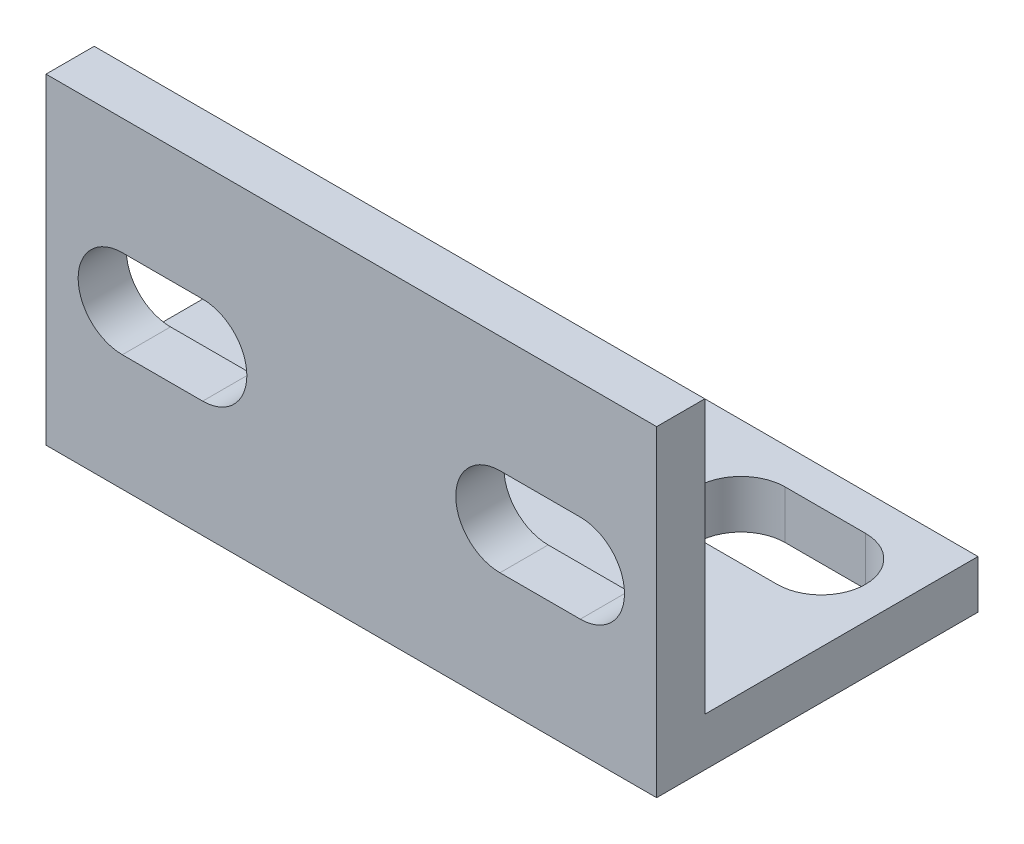
ISO-10303-21;
HEADER;
FILE_DESCRIPTION(('STEP AP214'),'2;1');
FILE_NAME('part.step','',(''),(''),'','','');
FILE_SCHEMA(('AUTOMOTIVE_DESIGN { 1 0 10303 214 1 1 1 1 }'));
ENDSEC;
DATA;
#1=APPLICATION_CONTEXT('core data for automotive mechanical design processes');
#2=APPLICATION_PROTOCOL_DEFINITION('international standard','automotive_design',2000,#1);
#3=PRODUCT_CONTEXT('',#1,'mechanical');
#4=PRODUCT('Part','Part','',(#3));
#5=PRODUCT_RELATED_PRODUCT_CATEGORY('part','',(#4));
#6=PRODUCT_DEFINITION_FORMATION('','',#4);
#7=PRODUCT_DEFINITION_CONTEXT('part definition',#1,'design');
#8=PRODUCT_DEFINITION('design','',#6,#7);
#9=PRODUCT_DEFINITION_SHAPE('','',#8);
#10=(LENGTH_UNIT() NAMED_UNIT(*) SI_UNIT(.MILLI.,.METRE.));
#11=(NAMED_UNIT(*) PLANE_ANGLE_UNIT() SI_UNIT($,.RADIAN.));
#12=(NAMED_UNIT(*) SI_UNIT($,.STERADIAN.) SOLID_ANGLE_UNIT());
#13=UNCERTAINTY_MEASURE_WITH_UNIT(LENGTH_MEASURE(1.E-05),#10,'distance_accuracy_value','');
#14=(GEOMETRIC_REPRESENTATION_CONTEXT(3) GLOBAL_UNCERTAINTY_ASSIGNED_CONTEXT((#13)) GLOBAL_UNIT_ASSIGNED_CONTEXT((#10,
#11,#12)) REPRESENTATION_CONTEXT('',''));
#15=CARTESIAN_POINT('',(0.,0.,0.));
#16=DIRECTION('',(0.,0.,1.));
#17=DIRECTION('',(1.,0.,0.));
#18=AXIS2_PLACEMENT_3D('',#15,#16,#17);
#19=CARTESIAN_POINT('',(-38.,3.,-20.));
#20=DIRECTION('',(0.,1.,0.));
#21=DIRECTION('',(0.,0.,1.));
#22=AXIS2_PLACEMENT_3D('',#19,#20,#21);
#23=PLANE('',#22);
#24=DIRECTION('',(0.,0.,1.));
#25=VECTOR('',#24,1.);
#26=CARTESIAN_POINT('',(0.,3.,-20.));
#27=LINE('',#26,#25);
#28=CARTESIAN_POINT('',(0.,3.,-20.));
#29=VERTEX_POINT('',#28);
#30=CARTESIAN_POINT('',(0.,3.,-3.));
#31=VERTEX_POINT('',#30);
#32=EDGE_CURVE('E343',#29,#31,#27,.T.);
#33=ORIENTED_EDGE('',*,*,#32,.F.);
#34=DIRECTION('',(1.,0.,0.));
#35=VECTOR('',#34,1.);
#36=CARTESIAN_POINT('',(-38.,3.,-20.));
#37=LINE('',#36,#35);
#38=CARTESIAN_POINT('',(-38.,3.,-20.));
#39=VERTEX_POINT('',#38);
#40=EDGE_CURVE('E349',#39,#29,#37,.T.);
#41=ORIENTED_EDGE('',*,*,#40,.F.);
#42=DIRECTION('',(0.,0.,1.));
#43=VECTOR('',#42,1.);
#44=CARTESIAN_POINT('',(-38.,3.,-20.));
#45=LINE('',#44,#43);
#46=CARTESIAN_POINT('',(-38.,3.,-3.));
#47=VERTEX_POINT('',#46);
#48=EDGE_CURVE('E326',#39,#47,#45,.T.);
#49=ORIENTED_EDGE('',*,*,#48,.T.);
#50=DIRECTION('',(1.,0.,0.));
#51=VECTOR('',#50,1.);
#52=CARTESIAN_POINT('',(-38.,3.,-3.));
#53=LINE('',#52,#51);
#54=EDGE_CURVE('E42',#47,#31,#53,.T.);
#55=ORIENTED_EDGE('',*,*,#54,.T.);
#56=EDGE_LOOP('',(#33,#41,#49,#55));
#57=FACE_BOUND('',#56,.T.);
#58=CARTESIAN_POINT('',(-4.75,3.,-15.));
#59=DIRECTION('',(0.,1.,0.));
#60=DIRECTION('',(0.,0.,1.));
#61=AXIS2_PLACEMENT_3D('',#58,#59,#60);
#62=CIRCLE('',#61,2.75);
#63=CARTESIAN_POINT('',(-4.75,3.,-12.25));
#64=VERTEX_POINT('',#63);
#65=CARTESIAN_POINT('',(-4.75,3.,-17.75));
#66=VERTEX_POINT('',#65);
#67=EDGE_CURVE('E243',#64,#66,#62,.T.);
#68=ORIENTED_EDGE('',*,*,#67,.F.);
#69=DIRECTION('',(1.,0.,0.));
#70=VECTOR('',#69,1.);
#71=CARTESIAN_POINT('',(-4.75,3.,-12.25));
#72=LINE('',#71,#70);
#73=CARTESIAN_POINT('',(-9.75,3.,-12.25));
#74=VERTEX_POINT('',#73);
#75=EDGE_CURVE('E254',#74,#64,#72,.T.);
#76=ORIENTED_EDGE('',*,*,#75,.F.);
#77=CARTESIAN_POINT('',(-9.75,3.,-15.));
#78=DIRECTION('',(0.,1.,0.));
#79=DIRECTION('',(0.,0.,1.));
#80=AXIS2_PLACEMENT_3D('',#77,#78,#79);
#81=CIRCLE('',#80,2.75);
#82=CARTESIAN_POINT('',(-9.75,3.,-17.75));
#83=VERTEX_POINT('',#82);
#84=EDGE_CURVE('E268',#83,#74,#81,.T.);
#85=ORIENTED_EDGE('',*,*,#84,.F.);
#86=DIRECTION('',(-1.,0.,0.));
#87=VECTOR('',#86,1.);
#88=CARTESIAN_POINT('',(-4.75,3.,-17.75));
#89=LINE('',#88,#87);
#90=EDGE_CURVE('E265',#66,#83,#89,.T.);
#91=ORIENTED_EDGE('',*,*,#90,.F.);
#92=EDGE_LOOP('',(#68,#76,#85,#91));
#93=FACE_BOUND('',#92,.T.);
#94=DIRECTION('',(-1.,0.,0.));
#95=VECTOR('',#94,1.);
#96=CARTESIAN_POINT('',(-33.25,3.,-12.25));
#97=LINE('',#96,#95);
#98=CARTESIAN_POINT('',(-28.25,3.,-12.25));
#99=VERTEX_POINT('',#98);
#100=CARTESIAN_POINT('',(-33.25,3.,-12.25));
#101=VERTEX_POINT('',#100);
#102=EDGE_CURVE('E208',#99,#101,#97,.T.);
#103=ORIENTED_EDGE('',*,*,#102,.T.);
#104=CARTESIAN_POINT('',(-33.25,3.,-15.));
#105=DIRECTION('',(0.,-1.,0.));
#106=DIRECTION('',(0.,0.,1.));
#107=AXIS2_PLACEMENT_3D('',#104,#105,#106);
#108=CIRCLE('',#107,2.75);
#109=CARTESIAN_POINT('',(-33.25,3.,-17.75));
#110=VERTEX_POINT('',#109);
#111=EDGE_CURVE('E50',#101,#110,#108,.T.);
#112=ORIENTED_EDGE('',*,*,#111,.T.);
#113=DIRECTION('',(1.,0.,0.));
#114=VECTOR('',#113,1.);
#115=CARTESIAN_POINT('',(-33.25,3.,-17.75));
#116=LINE('',#115,#114);
#117=CARTESIAN_POINT('',(-28.25,3.,-17.75));
#118=VERTEX_POINT('',#117);
#119=EDGE_CURVE('E199',#110,#118,#116,.T.);
#120=ORIENTED_EDGE('',*,*,#119,.T.);
#121=CARTESIAN_POINT('',(-28.25,3.,-15.));
#122=DIRECTION('',(0.,-1.,0.));
#123=DIRECTION('',(0.,0.,1.));
#124=AXIS2_PLACEMENT_3D('',#121,#122,#123);
#125=CIRCLE('',#124,2.75);
#126=EDGE_CURVE('E202',#118,#99,#125,.T.);
#127=ORIENTED_EDGE('',*,*,#126,.T.);
#128=EDGE_LOOP('',(#103,#112,#120,#127));
#129=FACE_BOUND('',#128,.T.);
#130=ADVANCED_FACE('F33',(#57,#93,#129),#23,.T.);
#131=CARTESIAN_POINT('',(-38.,0.,0.));
#132=DIRECTION('',(0.,-1.,0.));
#133=DIRECTION('',(0.,0.,-1.));
#134=AXIS2_PLACEMENT_3D('',#131,#132,#133);
#135=PLANE('',#134);
#136=DIRECTION('',(0.,0.,-1.));
#137=VECTOR('',#136,1.);
#138=CARTESIAN_POINT('',(0.,0.,0.));
#139=LINE('',#138,#137);
#140=CARTESIAN_POINT('',(0.,0.,0.));
#141=VERTEX_POINT('',#140);
#142=CARTESIAN_POINT('',(0.,0.,-20.));
#143=VERTEX_POINT('',#142);
#144=EDGE_CURVE('E337',#141,#143,#139,.T.);
#145=ORIENTED_EDGE('',*,*,#144,.F.);
#146=DIRECTION('',(1.,0.,0.));
#147=VECTOR('',#146,1.);
#148=CARTESIAN_POINT('',(-38.,0.,0.));
#149=LINE('',#148,#147);
#150=CARTESIAN_POINT('',(-38.,0.,0.));
#151=VERTEX_POINT('',#150);
#152=EDGE_CURVE('E352',#151,#141,#149,.T.);
#153=ORIENTED_EDGE('',*,*,#152,.F.);
#154=DIRECTION('',(0.,0.,-1.));
#155=VECTOR('',#154,1.);
#156=CARTESIAN_POINT('',(-38.,0.,0.));
#157=LINE('',#156,#155);
#158=CARTESIAN_POINT('',(-38.,0.,-20.));
#159=VERTEX_POINT('',#158);
#160=EDGE_CURVE('E320',#151,#159,#157,.T.);
#161=ORIENTED_EDGE('',*,*,#160,.T.);
#162=DIRECTION('',(1.,0.,0.));
#163=VECTOR('',#162,1.);
#164=CARTESIAN_POINT('',(-38.,0.,-20.));
#165=LINE('',#164,#163);
#166=EDGE_CURVE('E351',#159,#143,#165,.T.);
#167=ORIENTED_EDGE('',*,*,#166,.T.);
#168=EDGE_LOOP('',(#145,#153,#161,#167));
#169=FACE_BOUND('',#168,.T.);
#170=CARTESIAN_POINT('',(-4.75,0.,-15.));
#171=DIRECTION('',(0.,1.,0.));
#172=DIRECTION('',(0.,0.,1.));
#173=AXIS2_PLACEMENT_3D('',#170,#171,#172);
#174=CIRCLE('',#173,2.75);
#175=CARTESIAN_POINT('',(-4.75,0.,-12.25));
#176=VERTEX_POINT('',#175);
#177=CARTESIAN_POINT('',(-4.75,0.,-17.75));
#178=VERTEX_POINT('',#177);
#179=EDGE_CURVE('E250',#176,#178,#174,.T.);
#180=ORIENTED_EDGE('',*,*,#179,.T.);
#181=DIRECTION('',(-1.,0.,0.));
#182=VECTOR('',#181,1.);
#183=CARTESIAN_POINT('',(-4.75,0.,-17.75));
#184=LINE('',#183,#182);
#185=CARTESIAN_POINT('',(-9.75,0.,-17.75));
#186=VERTEX_POINT('',#185);
#187=EDGE_CURVE('E253',#178,#186,#184,.T.);
#188=ORIENTED_EDGE('',*,*,#187,.T.);
#189=CARTESIAN_POINT('',(-9.75,0.,-15.));
#190=DIRECTION('',(0.,1.,0.));
#191=DIRECTION('',(0.,0.,1.));
#192=AXIS2_PLACEMENT_3D('',#189,#190,#191);
#193=CIRCLE('',#192,2.75);
#194=CARTESIAN_POINT('',(-9.75,0.,-12.25));
#195=VERTEX_POINT('',#194);
#196=EDGE_CURVE('E257',#186,#195,#193,.T.);
#197=ORIENTED_EDGE('',*,*,#196,.T.);
#198=DIRECTION('',(1.,0.,0.));
#199=VECTOR('',#198,1.);
#200=CARTESIAN_POINT('',(-4.75,0.,-12.25));
#201=LINE('',#200,#199);
#202=EDGE_CURVE('E260',#195,#176,#201,.T.);
#203=ORIENTED_EDGE('',*,*,#202,.T.);
#204=EDGE_LOOP('',(#180,#188,#197,#203));
#205=FACE_BOUND('',#204,.T.);
#206=DIRECTION('',(1.,0.,0.));
#207=VECTOR('',#206,1.);
#208=CARTESIAN_POINT('',(-33.25,0.,-17.75));
#209=LINE('',#208,#207);
#210=CARTESIAN_POINT('',(-33.25,0.,-17.75));
#211=VERTEX_POINT('',#210);
#212=CARTESIAN_POINT('',(-28.25,0.,-17.75));
#213=VERTEX_POINT('',#212);
#214=EDGE_CURVE('E195',#211,#213,#209,.T.);
#215=ORIENTED_EDGE('',*,*,#214,.F.);
#216=CARTESIAN_POINT('',(-33.25,0.,-15.));
#217=DIRECTION('',(0.,-1.,0.));
#218=DIRECTION('',(0.,0.,1.));
#219=AXIS2_PLACEMENT_3D('',#216,#217,#218);
#220=CIRCLE('',#219,2.75);
#221=CARTESIAN_POINT('',(-33.25,0.,-12.25));
#222=VERTEX_POINT('',#221);
#223=EDGE_CURVE('E191',#222,#211,#220,.T.);
#224=ORIENTED_EDGE('',*,*,#223,.F.);
#225=DIRECTION('',(-1.,0.,0.));
#226=VECTOR('',#225,1.);
#227=CARTESIAN_POINT('',(-33.25,0.,-12.25));
#228=LINE('',#227,#226);
#229=CARTESIAN_POINT('',(-28.25,0.,-12.25));
#230=VERTEX_POINT('',#229);
#231=EDGE_CURVE('E183',#230,#222,#228,.T.);
#232=ORIENTED_EDGE('',*,*,#231,.F.);
#233=CARTESIAN_POINT('',(-28.25,0.,-15.));
#234=DIRECTION('',(0.,-1.,0.));
#235=DIRECTION('',(0.,0.,1.));
#236=AXIS2_PLACEMENT_3D('',#233,#234,#235);
#237=CIRCLE('',#236,2.75);
#238=EDGE_CURVE('E190',#213,#230,#237,.T.);
#239=ORIENTED_EDGE('',*,*,#238,.F.);
#240=EDGE_LOOP('',(#215,#224,#232,#239));
#241=FACE_BOUND('',#240,.T.);
#242=ADVANCED_FACE('F198',(#169,#205,#241),#135,.T.);
#243=CARTESIAN_POINT('',(-38.,3.,-3.));
#244=DIRECTION('',(0.,0.,-1.));
#245=DIRECTION('',(0.,1.,0.));
#246=AXIS2_PLACEMENT_3D('',#243,#244,#245);
#247=PLANE('',#246);
#248=DIRECTION('',(0.,1.,0.));
#249=VECTOR('',#248,1.);
#250=CARTESIAN_POINT('',(0.,3.,-3.));
#251=LINE('',#250,#249);
#252=CARTESIAN_POINT('',(0.,20.,-3.));
#253=VERTEX_POINT('',#252);
#254=EDGE_CURVE('E317',#31,#253,#251,.T.);
#255=ORIENTED_EDGE('',*,*,#254,.F.);
#256=ORIENTED_EDGE('',*,*,#54,.F.);
#257=DIRECTION('',(0.,1.,0.));
#258=VECTOR('',#257,1.);
#259=CARTESIAN_POINT('',(-38.,3.,-3.));
#260=LINE('',#259,#258);
#261=CARTESIAN_POINT('',(-38.,20.,-3.));
#262=VERTEX_POINT('',#261);
#263=EDGE_CURVE('E329',#47,#262,#260,.T.);
#264=ORIENTED_EDGE('',*,*,#263,.T.);
#265=DIRECTION('',(1.,0.,0.));
#266=VECTOR('',#265,1.);
#267=CARTESIAN_POINT('',(-38.,20.,-3.));
#268=LINE('',#267,#266);
#269=EDGE_CURVE('E11',#262,#253,#268,.T.);
#270=ORIENTED_EDGE('',*,*,#269,.T.);
#271=EDGE_LOOP('',(#255,#256,#264,#270));
#272=FACE_BOUND('',#271,.T.);
#273=CARTESIAN_POINT('',(-4.75,10.,-3.));
#274=DIRECTION('',(0.,0.,-1.));
#275=DIRECTION('',(0.,1.,0.));
#276=AXIS2_PLACEMENT_3D('',#273,#274,#275);
#277=CIRCLE('',#276,2.75);
#278=CARTESIAN_POINT('',(-4.75,12.75,-3.));
#279=VERTEX_POINT('',#278);
#280=CARTESIAN_POINT('',(-4.75,7.25000000000001,-3.));
#281=VERTEX_POINT('',#280);
#282=EDGE_CURVE('E275',#279,#281,#277,.T.);
#283=ORIENTED_EDGE('',*,*,#282,.F.);
#284=DIRECTION('',(-1.,0.,0.));
#285=VECTOR('',#284,1.);
#286=CARTESIAN_POINT('',(-4.75,12.75,-3.));
#287=LINE('',#286,#285);
#288=CARTESIAN_POINT('',(-9.75,12.75,-3.));
#289=VERTEX_POINT('',#288);
#290=EDGE_CURVE('E286',#279,#289,#287,.T.);
#291=ORIENTED_EDGE('',*,*,#290,.T.);
#292=CARTESIAN_POINT('',(-9.75,10.,-3.));
#293=DIRECTION('',(0.,0.,-1.));
#294=DIRECTION('',(0.,1.,0.));
#295=AXIS2_PLACEMENT_3D('',#292,#293,#294);
#296=CIRCLE('',#295,2.75);
#297=CARTESIAN_POINT('',(-9.75,7.25000000000001,-3.));
#298=VERTEX_POINT('',#297);
#299=EDGE_CURVE('E299',#298,#289,#296,.T.);
#300=ORIENTED_EDGE('',*,*,#299,.F.);
#301=DIRECTION('',(-1.,0.,0.));
#302=VECTOR('',#301,1.);
#303=CARTESIAN_POINT('',(-4.75,7.25000000000001,-3.));
#304=LINE('',#303,#302);
#305=EDGE_CURVE('E296',#281,#298,#304,.T.);
#306=ORIENTED_EDGE('',*,*,#305,.F.);
#307=EDGE_LOOP('',(#283,#291,#300,#306));
#308=FACE_BOUND('',#307,.T.);
#309=DIRECTION('',(1.,0.,0.));
#310=VECTOR('',#309,1.);
#311=CARTESIAN_POINT('',(-33.25,12.75,-3.));
#312=LINE('',#311,#310);
#313=CARTESIAN_POINT('',(-33.25,12.75,-3.));
#314=VERTEX_POINT('',#313);
#315=CARTESIAN_POINT('',(-28.25,12.75,-3.));
#316=VERTEX_POINT('',#315);
#317=EDGE_CURVE('E232',#314,#316,#312,.T.);
#318=ORIENTED_EDGE('',*,*,#317,.F.);
#319=CARTESIAN_POINT('',(-33.25,10.,-3.));
#320=DIRECTION('',(0.,0.,1.));
#321=DIRECTION('',(0.,1.,0.));
#322=AXIS2_PLACEMENT_3D('',#319,#320,#321);
#323=CIRCLE('',#322,2.75);
#324=CARTESIAN_POINT('',(-33.25,7.25000000000001,-3.));
#325=VERTEX_POINT('',#324);
#326=EDGE_CURVE('E214',#314,#325,#323,.T.);
#327=ORIENTED_EDGE('',*,*,#326,.T.);
#328=DIRECTION('',(1.,0.,0.));
#329=VECTOR('',#328,1.);
#330=CARTESIAN_POINT('',(-33.25,7.25000000000001,-3.));
#331=LINE('',#330,#329);
#332=CARTESIAN_POINT('',(-28.25,7.25000000000001,-3.));
#333=VERTEX_POINT('',#332);
#334=EDGE_CURVE('E221',#325,#333,#331,.T.);
#335=ORIENTED_EDGE('',*,*,#334,.T.);
#336=CARTESIAN_POINT('',(-28.25,10.,-3.));
#337=DIRECTION('',(0.,0.,1.));
#338=DIRECTION('',(0.,1.,0.));
#339=AXIS2_PLACEMENT_3D('',#336,#337,#338);
#340=CIRCLE('',#339,2.75);
#341=EDGE_CURVE('E235',#333,#316,#340,.T.);
#342=ORIENTED_EDGE('',*,*,#341,.T.);
#343=EDGE_LOOP('',(#318,#327,#335,#342));
#344=FACE_BOUND('',#343,.T.);
#345=ADVANCED_FACE('F367',(#272,#308,#344),#247,.T.);
#346=CARTESIAN_POINT('',(-38.,20.,0.));
#347=DIRECTION('',(0.,0.,1.));
#348=DIRECTION('',(0.,-1.,0.));
#349=AXIS2_PLACEMENT_3D('',#346,#347,#348);
#350=PLANE('',#349);
#351=DIRECTION('',(0.,-1.,0.));
#352=VECTOR('',#351,1.);
#353=CARTESIAN_POINT('',(0.,20.,0.));
#354=LINE('',#353,#352);
#355=CARTESIAN_POINT('',(0.,20.,0.));
#356=VERTEX_POINT('',#355);
#357=EDGE_CURVE('E334',#356,#141,#354,.T.);
#358=ORIENTED_EDGE('',*,*,#357,.F.);
#359=DIRECTION('',(1.,0.,0.));
#360=VECTOR('',#359,1.);
#361=CARTESIAN_POINT('',(-38.,20.,0.));
#362=LINE('',#361,#360);
#363=CARTESIAN_POINT('',(-38.,20.,0.));
#364=VERTEX_POINT('',#363);
#365=EDGE_CURVE('E37',#364,#356,#362,.T.);
#366=ORIENTED_EDGE('',*,*,#365,.F.);
#367=DIRECTION('',(0.,-1.,0.));
#368=VECTOR('',#367,1.);
#369=CARTESIAN_POINT('',(-38.,20.,0.));
#370=LINE('',#369,#368);
#371=EDGE_CURVE('E316',#364,#151,#370,.T.);
#372=ORIENTED_EDGE('',*,*,#371,.T.);
#373=ORIENTED_EDGE('',*,*,#152,.T.);
#374=EDGE_LOOP('',(#358,#366,#372,#373));
#375=FACE_BOUND('',#374,.T.);
#376=CARTESIAN_POINT('',(-4.75,10.,0.));
#377=DIRECTION('',(0.,0.,-1.));
#378=DIRECTION('',(0.,1.,0.));
#379=AXIS2_PLACEMENT_3D('',#376,#377,#378);
#380=CIRCLE('',#379,2.75);
#381=CARTESIAN_POINT('',(-4.75,12.75,0.));
#382=VERTEX_POINT('',#381);
#383=CARTESIAN_POINT('',(-4.75,7.25000000000001,0.));
#384=VERTEX_POINT('',#383);
#385=EDGE_CURVE('E282',#382,#384,#380,.T.);
#386=ORIENTED_EDGE('',*,*,#385,.T.);
#387=DIRECTION('',(-1.,0.,0.));
#388=VECTOR('',#387,1.);
#389=CARTESIAN_POINT('',(-4.75,7.25000000000001,0.));
#390=LINE('',#389,#388);
#391=CARTESIAN_POINT('',(-9.75,7.25000000000001,0.));
#392=VERTEX_POINT('',#391);
#393=EDGE_CURVE('E285',#384,#392,#390,.T.);
#394=ORIENTED_EDGE('',*,*,#393,.T.);
#395=CARTESIAN_POINT('',(-9.75,10.,0.));
#396=DIRECTION('',(0.,0.,-1.));
#397=DIRECTION('',(0.,1.,0.));
#398=AXIS2_PLACEMENT_3D('',#395,#396,#397);
#399=CIRCLE('',#398,2.75);
#400=CARTESIAN_POINT('',(-9.75,12.75,0.));
#401=VERTEX_POINT('',#400);
#402=EDGE_CURVE('E289',#392,#401,#399,.T.);
#403=ORIENTED_EDGE('',*,*,#402,.T.);
#404=DIRECTION('',(-1.,0.,0.));
#405=VECTOR('',#404,1.);
#406=CARTESIAN_POINT('',(-4.75,12.75,0.));
#407=LINE('',#406,#405);
#408=EDGE_CURVE('E292',#382,#401,#407,.T.);
#409=ORIENTED_EDGE('',*,*,#408,.F.);
#410=EDGE_LOOP('',(#386,#394,#403,#409));
#411=FACE_BOUND('',#410,.T.);
#412=DIRECTION('',(1.,0.,0.));
#413=VECTOR('',#412,1.);
#414=CARTESIAN_POINT('',(-33.25,7.25000000000001,0.));
#415=LINE('',#414,#413);
#416=CARTESIAN_POINT('',(-33.25,7.25000000000001,0.));
#417=VERTEX_POINT('',#416);
#418=CARTESIAN_POINT('',(-28.25,7.25000000000001,0.));
#419=VERTEX_POINT('',#418);
#420=EDGE_CURVE('E227',#417,#419,#415,.T.);
#421=ORIENTED_EDGE('',*,*,#420,.F.);
#422=CARTESIAN_POINT('',(-33.25,10.,0.));
#423=DIRECTION('',(0.,0.,1.));
#424=DIRECTION('',(0.,1.,0.));
#425=AXIS2_PLACEMENT_3D('',#422,#423,#424);
#426=CIRCLE('',#425,2.75);
#427=CARTESIAN_POINT('',(-33.25,12.75,0.));
#428=VERTEX_POINT('',#427);
#429=EDGE_CURVE('E218',#428,#417,#426,.T.);
#430=ORIENTED_EDGE('',*,*,#429,.F.);
#431=DIRECTION('',(1.,0.,0.));
#432=VECTOR('',#431,1.);
#433=CARTESIAN_POINT('',(-33.25,12.75,0.));
#434=LINE('',#433,#432);
#435=CARTESIAN_POINT('',(-28.25,12.75,0.));
#436=VERTEX_POINT('',#435);
#437=EDGE_CURVE('E220',#428,#436,#434,.T.);
#438=ORIENTED_EDGE('',*,*,#437,.T.);
#439=CARTESIAN_POINT('',(-28.25,10.,0.));
#440=DIRECTION('',(0.,0.,1.));
#441=DIRECTION('',(0.,1.,0.));
#442=AXIS2_PLACEMENT_3D('',#439,#440,#441);
#443=CIRCLE('',#442,2.75);
#444=EDGE_CURVE('E224',#419,#436,#443,.T.);
#445=ORIENTED_EDGE('',*,*,#444,.F.);
#446=EDGE_LOOP('',(#421,#430,#438,#445));
#447=FACE_BOUND('',#446,.T.);
#448=ADVANCED_FACE('F360',(#375,#411,#447),#350,.T.);
#449=CARTESIAN_POINT('',(-38.,20.,-3.));
#450=DIRECTION('',(0.,1.,0.));
#451=DIRECTION('',(0.,0.,1.));
#452=AXIS2_PLACEMENT_3D('',#449,#450,#451);
#453=PLANE('',#452);
#454=DIRECTION('',(0.,0.,1.));
#455=VECTOR('',#454,1.);
#456=CARTESIAN_POINT('',(0.,20.,-3.));
#457=LINE('',#456,#455);
#458=EDGE_CURVE('E306',#253,#356,#457,.T.);
#459=ORIENTED_EDGE('',*,*,#458,.F.);
#460=ORIENTED_EDGE('',*,*,#269,.F.);
#461=DIRECTION('',(0.,0.,1.));
#462=VECTOR('',#461,1.);
#463=CARTESIAN_POINT('',(-38.,20.,-3.));
#464=LINE('',#463,#462);
#465=EDGE_CURVE('E313',#262,#364,#464,.T.);
#466=ORIENTED_EDGE('',*,*,#465,.T.);
#467=ORIENTED_EDGE('',*,*,#365,.T.);
#468=EDGE_LOOP('',(#459,#460,#466,#467));
#469=FACE_BOUND('',#468,.T.);
#470=ADVANCED_FACE('F35',(#469),#453,.T.);
#471=CARTESIAN_POINT('',(-38.,0.,-20.));
#472=DIRECTION('',(0.,0.,-1.));
#473=DIRECTION('',(-1.,0.,0.));
#474=AXIS2_PLACEMENT_3D('',#471,#472,#473);
#475=PLANE('',#474);
#476=DIRECTION('',(0.,1.,0.));
#477=VECTOR('',#476,1.);
#478=CARTESIAN_POINT('',(0.,0.,-20.));
#479=LINE('',#478,#477);
#480=EDGE_CURVE('E340',#143,#29,#479,.T.);
#481=ORIENTED_EDGE('',*,*,#480,.F.);
#482=ORIENTED_EDGE('',*,*,#166,.F.);
#483=DIRECTION('',(0.,1.,0.));
#484=VECTOR('',#483,1.);
#485=CARTESIAN_POINT('',(-38.,0.,-20.));
#486=LINE('',#485,#484);
#487=EDGE_CURVE('E323',#159,#39,#486,.T.);
#488=ORIENTED_EDGE('',*,*,#487,.T.);
#489=ORIENTED_EDGE('',*,*,#40,.T.);
#490=EDGE_LOOP('',(#481,#482,#488,#489));
#491=FACE_BOUND('',#490,.T.);
#492=ADVANCED_FACE('F379',(#491),#475,.T.);
#493=CARTESIAN_POINT('',(-38.,0.,0.));
#494=DIRECTION('',(1.,0.,0.));
#495=DIRECTION('',(0.,0.,-1.));
#496=AXIS2_PLACEMENT_3D('',#493,#494,#495);
#497=PLANE('',#496);
#498=ORIENTED_EDGE('',*,*,#465,.F.);
#499=ORIENTED_EDGE('',*,*,#263,.F.);
#500=ORIENTED_EDGE('',*,*,#48,.F.);
#501=ORIENTED_EDGE('',*,*,#487,.F.);
#502=ORIENTED_EDGE('',*,*,#160,.F.);
#503=ORIENTED_EDGE('',*,*,#371,.F.);
#504=EDGE_LOOP('',(#498,#499,#500,#501,#502,#503));
#505=FACE_BOUND('',#504,.T.);
#506=ADVANCED_FACE('F371',(#505),#497,.F.);
#507=CARTESIAN_POINT('',(0.,0.,0.));
#508=DIRECTION('',(1.,0.,0.));
#509=DIRECTION('',(0.,0.,-1.));
#510=AXIS2_PLACEMENT_3D('',#507,#508,#509);
#511=PLANE('',#510);
#512=ORIENTED_EDGE('',*,*,#458,.T.);
#513=ORIENTED_EDGE('',*,*,#357,.T.);
#514=ORIENTED_EDGE('',*,*,#144,.T.);
#515=ORIENTED_EDGE('',*,*,#480,.T.);
#516=ORIENTED_EDGE('',*,*,#32,.T.);
#517=ORIENTED_EDGE('',*,*,#254,.T.);
#518=EDGE_LOOP('',(#512,#513,#514,#515,#516,#517));
#519=FACE_BOUND('',#518,.T.);
#520=ADVANCED_FACE('F363',(#519),#511,.T.);
#521=CARTESIAN_POINT('',(-4.75,10.,0.));
#522=DIRECTION('',(0.,0.,-1.));
#523=DIRECTION('',(0.,1.,0.));
#524=AXIS2_PLACEMENT_3D('',#521,#522,#523);
#525=CYLINDRICAL_SURFACE('',#524,2.75);
#526=ORIENTED_EDGE('',*,*,#282,.T.);
#527=DIRECTION('',(0.,0.,-1.));
#528=VECTOR('',#527,1.);
#529=CARTESIAN_POINT('',(-4.75,7.25000000000001,0.));
#530=LINE('',#529,#528);
#531=EDGE_CURVE('E294',#384,#281,#530,.T.);
#532=ORIENTED_EDGE('',*,*,#531,.F.);
#533=ORIENTED_EDGE('',*,*,#385,.F.);
#534=DIRECTION('',(0.,0.,-1.));
#535=VECTOR('',#534,1.);
#536=CARTESIAN_POINT('',(-4.75,12.75,0.));
#537=LINE('',#536,#535);
#538=EDGE_CURVE('E304',#382,#279,#537,.T.);
#539=ORIENTED_EDGE('',*,*,#538,.T.);
#540=EDGE_LOOP('',(#526,#532,#533,#539));
#541=FACE_BOUND('',#540,.T.);
#542=ADVANCED_FACE('F442',(#541),#525,.F.);
#543=CARTESIAN_POINT('',(-4.75,12.75,0.));
#544=DIRECTION('',(0.,-1.,0.));
#545=DIRECTION('',(1.,0.,0.));
#546=AXIS2_PLACEMENT_3D('',#543,#544,#545);
#547=PLANE('',#546);
#548=ORIENTED_EDGE('',*,*,#290,.F.);
#549=ORIENTED_EDGE('',*,*,#538,.F.);
#550=ORIENTED_EDGE('',*,*,#408,.T.);
#551=DIRECTION('',(0.,0.,-1.));
#552=VECTOR('',#551,1.);
#553=CARTESIAN_POINT('',(-9.75,12.75,0.));
#554=LINE('',#553,#552);
#555=EDGE_CURVE('E307',#401,#289,#554,.T.);
#556=ORIENTED_EDGE('',*,*,#555,.T.);
#557=EDGE_LOOP('',(#548,#549,#550,#556));
#558=FACE_BOUND('',#557,.T.);
#559=ADVANCED_FACE('F438',(#558),#547,.T.);
#560=CARTESIAN_POINT('',(-9.75,10.,0.));
#561=DIRECTION('',(0.,0.,-1.));
#562=DIRECTION('',(0.,1.,0.));
#563=AXIS2_PLACEMENT_3D('',#560,#561,#562);
#564=CYLINDRICAL_SURFACE('',#563,2.75);
#565=ORIENTED_EDGE('',*,*,#299,.T.);
#566=ORIENTED_EDGE('',*,*,#555,.F.);
#567=ORIENTED_EDGE('',*,*,#402,.F.);
#568=DIRECTION('',(0.,0.,-1.));
#569=VECTOR('',#568,1.);
#570=CARTESIAN_POINT('',(-9.75,7.25000000000001,0.));
#571=LINE('',#570,#569);
#572=EDGE_CURVE('E309',#392,#298,#571,.T.);
#573=ORIENTED_EDGE('',*,*,#572,.T.);
#574=EDGE_LOOP('',(#565,#566,#567,#573));
#575=FACE_BOUND('',#574,.T.);
#576=ADVANCED_FACE('F441',(#575),#564,.F.);
#577=CARTESIAN_POINT('',(-4.75,7.25000000000001,0.));
#578=DIRECTION('',(0.,-1.,0.));
#579=DIRECTION('',(1.,0.,0.));
#580=AXIS2_PLACEMENT_3D('',#577,#578,#579);
#581=PLANE('',#580);
#582=ORIENTED_EDGE('',*,*,#305,.T.);
#583=ORIENTED_EDGE('',*,*,#572,.F.);
#584=ORIENTED_EDGE('',*,*,#393,.F.);
#585=ORIENTED_EDGE('',*,*,#531,.T.);
#586=EDGE_LOOP('',(#582,#583,#584,#585));
#587=FACE_BOUND('',#586,.T.);
#588=ADVANCED_FACE('F436',(#587),#581,.F.);
#589=CARTESIAN_POINT('',(-4.75,0.,-15.));
#590=DIRECTION('',(0.,1.,0.));
#591=DIRECTION('',(0.,0.,1.));
#592=AXIS2_PLACEMENT_3D('',#589,#590,#591);
#593=CYLINDRICAL_SURFACE('',#592,2.75);
#594=ORIENTED_EDGE('',*,*,#67,.T.);
#595=DIRECTION('',(0.,1.,0.));
#596=VECTOR('',#595,1.);
#597=CARTESIAN_POINT('',(-4.75,0.,-17.75));
#598=LINE('',#597,#596);
#599=EDGE_CURVE('E263',#178,#66,#598,.T.);
#600=ORIENTED_EDGE('',*,*,#599,.F.);
#601=ORIENTED_EDGE('',*,*,#179,.F.);
#602=DIRECTION('',(0.,1.,0.));
#603=VECTOR('',#602,1.);
#604=CARTESIAN_POINT('',(-4.75,0.,-12.25));
#605=LINE('',#604,#603);
#606=EDGE_CURVE('E273',#176,#64,#605,.T.);
#607=ORIENTED_EDGE('',*,*,#606,.T.);
#608=EDGE_LOOP('',(#594,#600,#601,#607));
#609=FACE_BOUND('',#608,.T.);
#610=ADVANCED_FACE('F426',(#609),#593,.F.);
#611=CARTESIAN_POINT('',(-4.75,0.,-12.25));
#612=DIRECTION('',(0.,0.,1.));
#613=DIRECTION('',(0.,-1.,0.));
#614=AXIS2_PLACEMENT_3D('',#611,#612,#613);
#615=PLANE('',#614);
#616=ORIENTED_EDGE('',*,*,#75,.T.);
#617=ORIENTED_EDGE('',*,*,#606,.F.);
#618=ORIENTED_EDGE('',*,*,#202,.F.);
#619=DIRECTION('',(0.,1.,0.));
#620=VECTOR('',#619,1.);
#621=CARTESIAN_POINT('',(-9.75,0.,-12.25));
#622=LINE('',#621,#620);
#623=EDGE_CURVE('E276',#195,#74,#622,.T.);
#624=ORIENTED_EDGE('',*,*,#623,.T.);
#625=EDGE_LOOP('',(#616,#617,#618,#624));
#626=FACE_BOUND('',#625,.T.);
#627=ADVANCED_FACE('F422',(#626),#615,.F.);
#628=CARTESIAN_POINT('',(-9.75,0.,-15.));
#629=DIRECTION('',(0.,1.,0.));
#630=DIRECTION('',(0.,0.,1.));
#631=AXIS2_PLACEMENT_3D('',#628,#629,#630);
#632=CYLINDRICAL_SURFACE('',#631,2.75);
#633=ORIENTED_EDGE('',*,*,#84,.T.);
#634=ORIENTED_EDGE('',*,*,#623,.F.);
#635=ORIENTED_EDGE('',*,*,#196,.F.);
#636=DIRECTION('',(0.,1.,0.));
#637=VECTOR('',#636,1.);
#638=CARTESIAN_POINT('',(-9.75,0.,-17.75));
#639=LINE('',#638,#637);
#640=EDGE_CURVE('E278',#186,#83,#639,.T.);
#641=ORIENTED_EDGE('',*,*,#640,.T.);
#642=EDGE_LOOP('',(#633,#634,#635,#641));
#643=FACE_BOUND('',#642,.T.);
#644=ADVANCED_FACE('F425',(#643),#632,.F.);
#645=CARTESIAN_POINT('',(-4.75,0.,-17.75));
#646=DIRECTION('',(0.,0.,-1.));
#647=DIRECTION('',(0.,1.,0.));
#648=AXIS2_PLACEMENT_3D('',#645,#646,#647);
#649=PLANE('',#648);
#650=ORIENTED_EDGE('',*,*,#90,.T.);
#651=ORIENTED_EDGE('',*,*,#640,.F.);
#652=ORIENTED_EDGE('',*,*,#187,.F.);
#653=ORIENTED_EDGE('',*,*,#599,.T.);
#654=EDGE_LOOP('',(#650,#651,#652,#653));
#655=FACE_BOUND('',#654,.T.);
#656=ADVANCED_FACE('F420',(#655),#649,.F.);
#657=CARTESIAN_POINT('',(-33.25,10.,0.));
#658=DIRECTION('',(0.,0.,-1.));
#659=DIRECTION('',(0.,1.,0.));
#660=AXIS2_PLACEMENT_3D('',#657,#658,#659);
#661=CYLINDRICAL_SURFACE('',#660,2.75);
#662=ORIENTED_EDGE('',*,*,#326,.F.);
#663=DIRECTION('',(0.,0.,-1.));
#664=VECTOR('',#663,1.);
#665=CARTESIAN_POINT('',(-33.25,12.75,0.));
#666=LINE('',#665,#664);
#667=EDGE_CURVE('E229',#428,#314,#666,.T.);
#668=ORIENTED_EDGE('',*,*,#667,.F.);
#669=ORIENTED_EDGE('',*,*,#429,.T.);
#670=DIRECTION('',(0.,0.,-1.));
#671=VECTOR('',#670,1.);
#672=CARTESIAN_POINT('',(-33.25,7.25000000000001,0.));
#673=LINE('',#672,#671);
#674=EDGE_CURVE('E240',#417,#325,#673,.T.);
#675=ORIENTED_EDGE('',*,*,#674,.T.);
#676=EDGE_LOOP('',(#662,#668,#669,#675));
#677=FACE_BOUND('',#676,.T.);
#678=ADVANCED_FACE('F410',(#677),#661,.F.);
#679=CARTESIAN_POINT('',(-33.25,7.25000000000001,0.));
#680=DIRECTION('',(0.,1.,0.));
#681=DIRECTION('',(-1.,0.,0.));
#682=AXIS2_PLACEMENT_3D('',#679,#680,#681);
#683=PLANE('',#682);
#684=ORIENTED_EDGE('',*,*,#334,.F.);
#685=ORIENTED_EDGE('',*,*,#674,.F.);
#686=ORIENTED_EDGE('',*,*,#420,.T.);
#687=DIRECTION('',(0.,0.,-1.));
#688=VECTOR('',#687,1.);
#689=CARTESIAN_POINT('',(-28.25,7.25000000000001,0.));
#690=LINE('',#689,#688);
#691=EDGE_CURVE('E244',#419,#333,#690,.T.);
#692=ORIENTED_EDGE('',*,*,#691,.T.);
#693=EDGE_LOOP('',(#684,#685,#686,#692));
#694=FACE_BOUND('',#693,.T.);
#695=ADVANCED_FACE('F406',(#694),#683,.T.);
#696=CARTESIAN_POINT('',(-28.25,10.,0.));
#697=DIRECTION('',(0.,0.,-1.));
#698=DIRECTION('',(0.,1.,0.));
#699=AXIS2_PLACEMENT_3D('',#696,#697,#698);
#700=CYLINDRICAL_SURFACE('',#699,2.75);
#701=ORIENTED_EDGE('',*,*,#341,.F.);
#702=ORIENTED_EDGE('',*,*,#691,.F.);
#703=ORIENTED_EDGE('',*,*,#444,.T.);
#704=DIRECTION('',(0.,0.,-1.));
#705=VECTOR('',#704,1.);
#706=CARTESIAN_POINT('',(-28.25,12.75,0.));
#707=LINE('',#706,#705);
#708=EDGE_CURVE('E246',#436,#316,#707,.T.);
#709=ORIENTED_EDGE('',*,*,#708,.T.);
#710=EDGE_LOOP('',(#701,#702,#703,#709));
#711=FACE_BOUND('',#710,.T.);
#712=ADVANCED_FACE('F409',(#711),#700,.F.);
#713=CARTESIAN_POINT('',(-33.25,12.75,0.));
#714=DIRECTION('',(0.,1.,0.));
#715=DIRECTION('',(-1.,0.,0.));
#716=AXIS2_PLACEMENT_3D('',#713,#714,#715);
#717=PLANE('',#716);
#718=ORIENTED_EDGE('',*,*,#317,.T.);
#719=ORIENTED_EDGE('',*,*,#708,.F.);
#720=ORIENTED_EDGE('',*,*,#437,.F.);
#721=ORIENTED_EDGE('',*,*,#667,.T.);
#722=EDGE_LOOP('',(#718,#719,#720,#721));
#723=FACE_BOUND('',#722,.T.);
#724=ADVANCED_FACE('F401',(#723),#717,.F.);
#725=CARTESIAN_POINT('',(-33.25,0.,-15.));
#726=DIRECTION('',(0.,1.,0.));
#727=DIRECTION('',(0.,0.,1.));
#728=AXIS2_PLACEMENT_3D('',#725,#726,#727);
#729=CYLINDRICAL_SURFACE('',#728,2.75);
#730=ORIENTED_EDGE('',*,*,#111,.F.);
#731=DIRECTION('',(0.,1.,0.));
#732=VECTOR('',#731,1.);
#733=CARTESIAN_POINT('',(-33.25,0.,-12.25));
#734=LINE('',#733,#732);
#735=EDGE_CURVE('E185',#222,#101,#734,.T.);
#736=ORIENTED_EDGE('',*,*,#735,.F.);
#737=ORIENTED_EDGE('',*,*,#223,.T.);
#738=DIRECTION('',(0.,1.,0.));
#739=VECTOR('',#738,1.);
#740=CARTESIAN_POINT('',(-33.25,0.,-17.75));
#741=LINE('',#740,#739);
#742=EDGE_CURVE('E212',#211,#110,#741,.T.);
#743=ORIENTED_EDGE('',*,*,#742,.T.);
#744=EDGE_LOOP('',(#730,#736,#737,#743));
#745=FACE_BOUND('',#744,.T.);
#746=ADVANCED_FACE('F193',(#745),#729,.F.);
#747=CARTESIAN_POINT('',(-33.25,0.,-17.75));
#748=DIRECTION('',(0.,0.,1.));
#749=DIRECTION('',(0.,-1.,0.));
#750=AXIS2_PLACEMENT_3D('',#747,#748,#749);
#751=PLANE('',#750);
#752=ORIENTED_EDGE('',*,*,#119,.F.);
#753=ORIENTED_EDGE('',*,*,#742,.F.);
#754=ORIENTED_EDGE('',*,*,#214,.T.);
#755=DIRECTION('',(0.,1.,0.));
#756=VECTOR('',#755,1.);
#757=CARTESIAN_POINT('',(-28.25,0.,-17.75));
#758=LINE('',#757,#756);
#759=EDGE_CURVE('E215',#213,#118,#758,.T.);
#760=ORIENTED_EDGE('',*,*,#759,.T.);
#761=EDGE_LOOP('',(#752,#753,#754,#760));
#762=FACE_BOUND('',#761,.T.);
#763=ADVANCED_FACE('F393',(#762),#751,.T.);
#764=CARTESIAN_POINT('',(-28.25,0.,-15.));
#765=DIRECTION('',(0.,1.,0.));
#766=DIRECTION('',(0.,0.,1.));
#767=AXIS2_PLACEMENT_3D('',#764,#765,#766);
#768=CYLINDRICAL_SURFACE('',#767,2.75);
#769=ORIENTED_EDGE('',*,*,#126,.F.);
#770=ORIENTED_EDGE('',*,*,#759,.F.);
#771=ORIENTED_EDGE('',*,*,#238,.T.);
#772=DIRECTION('',(0.,1.,0.));
#773=VECTOR('',#772,1.);
#774=CARTESIAN_POINT('',(-28.25,0.,-12.25));
#775=LINE('',#774,#773);
#776=EDGE_CURVE('E58',#230,#99,#775,.T.);
#777=ORIENTED_EDGE('',*,*,#776,.T.);
#778=EDGE_LOOP('',(#769,#770,#771,#777));
#779=FACE_BOUND('',#778,.T.);
#780=ADVANCED_FACE('F391',(#779),#768,.F.);
#781=CARTESIAN_POINT('',(-33.25,0.,-12.25));
#782=DIRECTION('',(0.,0.,-1.));
#783=DIRECTION('',(0.,1.,0.));
#784=AXIS2_PLACEMENT_3D('',#781,#782,#783);
#785=PLANE('',#784);
#786=ORIENTED_EDGE('',*,*,#102,.F.);
#787=ORIENTED_EDGE('',*,*,#776,.F.);
#788=ORIENTED_EDGE('',*,*,#231,.T.);
#789=ORIENTED_EDGE('',*,*,#735,.T.);
#790=EDGE_LOOP('',(#786,#787,#788,#789));
#791=FACE_BOUND('',#790,.T.);
#792=ADVANCED_FACE('F184',(#791),#785,.T.);
#793=CLOSED_SHELL('',(#130,#242,#345,#448,#470,#492,#506,#520,#542,#559,#576,#588,#610,#627,
#644,#656,#678,#695,#712,#724,#746,#763,#780,#792));
#794=MANIFOLD_SOLID_BREP('B2',#793);
#795=ADVANCED_BREP_SHAPE_REPRESENTATION('',(#18,#794),#14);
#796=SHAPE_DEFINITION_REPRESENTATION(#9,#795);
ENDSEC;
END-ISO-10303-21;
